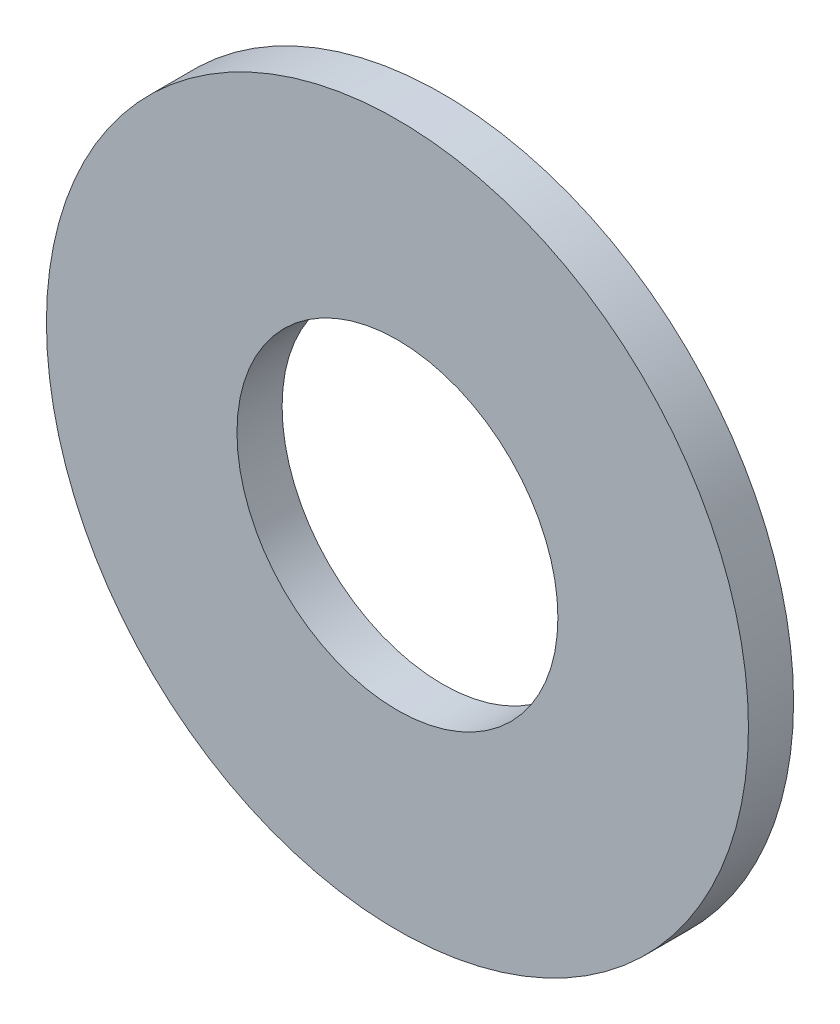
ISO-10303-21;
HEADER;
FILE_DESCRIPTION(('STEP AP214'),'2;1');
FILE_NAME('part.step','',(''),(''),'','','');
FILE_SCHEMA(('AUTOMOTIVE_DESIGN { 1 0 10303 214 1 1 1 1 }'));
ENDSEC;
DATA;
#1=APPLICATION_CONTEXT('core data for automotive mechanical design processes');
#2=APPLICATION_PROTOCOL_DEFINITION('international standard','automotive_design',2000,#1);
#3=PRODUCT_CONTEXT('',#1,'mechanical');
#4=PRODUCT('Part','Part','',(#3));
#5=PRODUCT_RELATED_PRODUCT_CATEGORY('part','',(#4));
#6=PRODUCT_DEFINITION_FORMATION('','',#4);
#7=PRODUCT_DEFINITION_CONTEXT('part definition',#1,'design');
#8=PRODUCT_DEFINITION('design','',#6,#7);
#9=PRODUCT_DEFINITION_SHAPE('','',#8);
#10=(LENGTH_UNIT() NAMED_UNIT(*) SI_UNIT(.MILLI.,.METRE.));
#11=(NAMED_UNIT(*) PLANE_ANGLE_UNIT() SI_UNIT($,.RADIAN.));
#12=(NAMED_UNIT(*) SI_UNIT($,.STERADIAN.) SOLID_ANGLE_UNIT());
#13=UNCERTAINTY_MEASURE_WITH_UNIT(LENGTH_MEASURE(1.E-05),#10,'distance_accuracy_value','');
#14=(GEOMETRIC_REPRESENTATION_CONTEXT(3) GLOBAL_UNCERTAINTY_ASSIGNED_CONTEXT((#13)) GLOBAL_UNIT_ASSIGNED_CONTEXT((#10,
#11,#12)) REPRESENTATION_CONTEXT('',''));
#15=CARTESIAN_POINT('',(0.,0.,0.));
#16=DIRECTION('',(0.,0.,1.));
#17=DIRECTION('',(1.,0.,0.));
#18=AXIS2_PLACEMENT_3D('',#15,#16,#17);
#19=CARTESIAN_POINT('',(0.,0.,-0.45));
#20=DIRECTION('',(0.,0.,1.));
#21=DIRECTION('',(1.,0.,0.));
#22=AXIS2_PLACEMENT_3D('',#19,#20,#21);
#23=CYLINDRICAL_SURFACE('',#22,3.5);
#24=CARTESIAN_POINT('',(0.,0.,-0.45));
#25=DIRECTION('',(0.,0.,1.));
#26=DIRECTION('',(1.,0.,0.));
#27=AXIS2_PLACEMENT_3D('',#24,#25,#26);
#28=CIRCLE('',#27,3.5);
#29=CARTESIAN_POINT('',(3.5,0.,-0.45));
#30=VERTEX_POINT('',#29);
#31=EDGE_CURVE('E10',#30,#30,#28,.T.);
#32=ORIENTED_EDGE('',*,*,#31,.T.);
#33=EDGE_LOOP('',(#32));
#34=FACE_BOUND('',#33,.T.);
#35=CARTESIAN_POINT('',(0.,0.,0.));
#36=DIRECTION('',(0.,0.,1.));
#37=DIRECTION('',(1.,0.,0.));
#38=AXIS2_PLACEMENT_3D('',#35,#36,#37);
#39=CIRCLE('',#38,3.5);
#40=CARTESIAN_POINT('',(3.5,0.,0.));
#41=VERTEX_POINT('',#40);
#42=EDGE_CURVE('E35',#41,#41,#39,.T.);
#43=ORIENTED_EDGE('',*,*,#42,.F.);
#44=EDGE_LOOP('',(#43));
#45=FACE_BOUND('',#44,.T.);
#46=ADVANCED_FACE('F32',(#34,#45),#23,.T.);
#47=CARTESIAN_POINT('',(0.,0.,-0.45));
#48=DIRECTION('',(0.,0.,1.));
#49=DIRECTION('',(1.,0.,0.));
#50=AXIS2_PLACEMENT_3D('',#47,#48,#49);
#51=PLANE('',#50);
#52=CARTESIAN_POINT('',(0.,0.,-0.45));
#53=DIRECTION('',(0.,0.,1.));
#54=DIRECTION('',(1.,0.,0.));
#55=AXIS2_PLACEMENT_3D('',#52,#53,#54);
#56=CIRCLE('',#55,1.6);
#57=CARTESIAN_POINT('',(1.6,0.,-0.45));
#58=VERTEX_POINT('',#57);
#59=EDGE_CURVE('E42',#58,#58,#56,.T.);
#60=ORIENTED_EDGE('',*,*,#59,.T.);
#61=EDGE_LOOP('',(#60));
#62=FACE_BOUND('',#61,.T.);
#63=ORIENTED_EDGE('',*,*,#31,.F.);
#64=EDGE_LOOP('',(#63));
#65=FACE_BOUND('',#64,.T.);
#66=ADVANCED_FACE('F50',(#62,#65),#51,.F.);
#67=CARTESIAN_POINT('',(0.,0.,0.));
#68=DIRECTION('',(0.,0.,1.));
#69=DIRECTION('',(1.,0.,0.));
#70=AXIS2_PLACEMENT_3D('',#67,#68,#69);
#71=PLANE('',#70);
#72=CARTESIAN_POINT('',(0.,0.,0.));
#73=DIRECTION('',(0.,0.,1.));
#74=DIRECTION('',(1.,0.,0.));
#75=AXIS2_PLACEMENT_3D('',#72,#73,#74);
#76=CIRCLE('',#75,1.6);
#77=CARTESIAN_POINT('',(1.6,0.,0.));
#78=VERTEX_POINT('',#77);
#79=EDGE_CURVE('E44',#78,#78,#76,.T.);
#80=ORIENTED_EDGE('',*,*,#79,.F.);
#81=EDGE_LOOP('',(#80));
#82=FACE_BOUND('',#81,.T.);
#83=ORIENTED_EDGE('',*,*,#42,.T.);
#84=EDGE_LOOP('',(#83));
#85=FACE_BOUND('',#84,.T.);
#86=ADVANCED_FACE('F56',(#82,#85),#71,.T.);
#87=CARTESIAN_POINT('',(0.,0.,-0.45));
#88=DIRECTION('',(0.,0.,1.));
#89=DIRECTION('',(1.,0.,0.));
#90=AXIS2_PLACEMENT_3D('',#87,#88,#89);
#91=CYLINDRICAL_SURFACE('',#90,1.6);
#92=ORIENTED_EDGE('',*,*,#59,.F.);
#93=EDGE_LOOP('',(#92));
#94=FACE_BOUND('',#93,.T.);
#95=ORIENTED_EDGE('',*,*,#79,.T.);
#96=EDGE_LOOP('',(#95));
#97=FACE_BOUND('',#96,.T.);
#98=ADVANCED_FACE('F53',(#94,#97),#91,.F.);
#99=CLOSED_SHELL('',(#46,#66,#86,#98));
#100=MANIFOLD_SOLID_BREP('B2',#99);
#101=ADVANCED_BREP_SHAPE_REPRESENTATION('',(#18,#100),#14);
#102=SHAPE_DEFINITION_REPRESENTATION(#9,#101);
ENDSEC;
END-ISO-10303-21;
